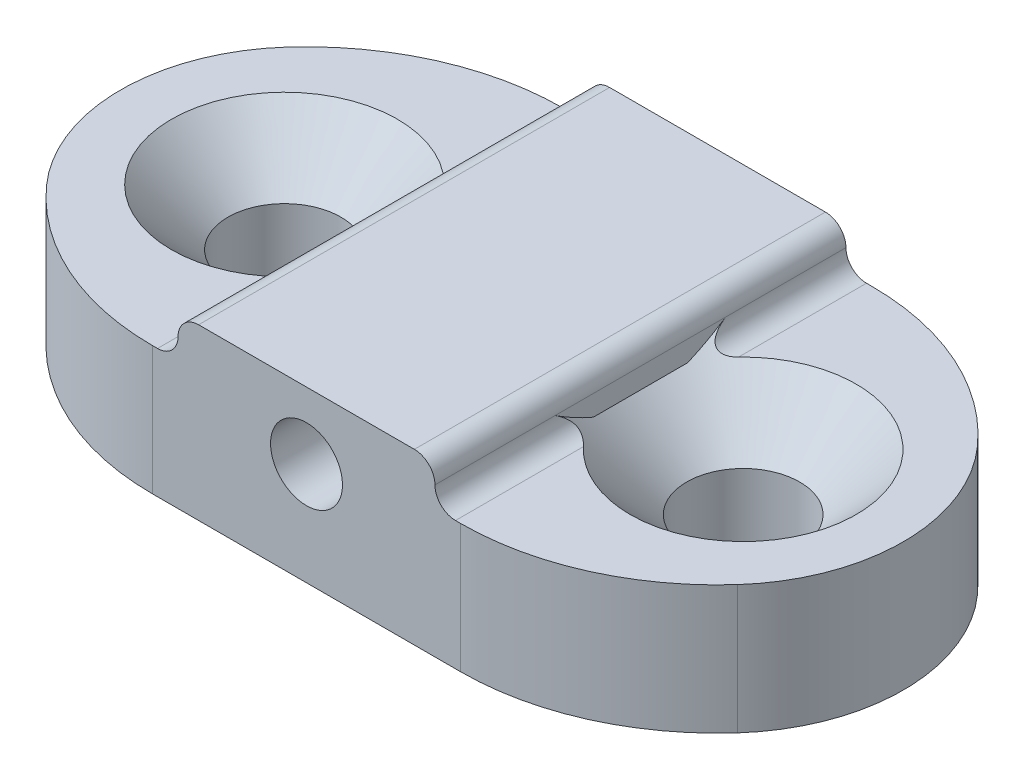
ISO-10303-21;
HEADER;
FILE_DESCRIPTION(('STEP AP214'),'2;1');
FILE_NAME('part.step','',(''),(''),'','','');
FILE_SCHEMA(('AUTOMOTIVE_DESIGN { 1 0 10303 214 1 1 1 1 }'));
ENDSEC;
DATA;
#1=APPLICATION_CONTEXT('core data for automotive mechanical design processes');
#2=APPLICATION_PROTOCOL_DEFINITION('international standard','automotive_design',2000,#1);
#3=PRODUCT_CONTEXT('',#1,'mechanical');
#4=PRODUCT('Part','Part','',(#3));
#5=PRODUCT_RELATED_PRODUCT_CATEGORY('part','',(#4));
#6=PRODUCT_DEFINITION_FORMATION('','',#4);
#7=PRODUCT_DEFINITION_CONTEXT('part definition',#1,'design');
#8=PRODUCT_DEFINITION('design','',#6,#7);
#9=PRODUCT_DEFINITION_SHAPE('','',#8);
#10=(LENGTH_UNIT() NAMED_UNIT(*) SI_UNIT(.MILLI.,.METRE.));
#11=(NAMED_UNIT(*) PLANE_ANGLE_UNIT() SI_UNIT($,.RADIAN.));
#12=(NAMED_UNIT(*) SI_UNIT($,.STERADIAN.) SOLID_ANGLE_UNIT());
#13=UNCERTAINTY_MEASURE_WITH_UNIT(LENGTH_MEASURE(1.E-05),#10,'distance_accuracy_value','');
#14=(GEOMETRIC_REPRESENTATION_CONTEXT(3) GLOBAL_UNCERTAINTY_ASSIGNED_CONTEXT((#13)) GLOBAL_UNIT_ASSIGNED_CONTEXT((#10,
#11,#12)) REPRESENTATION_CONTEXT('',''));
#15=CARTESIAN_POINT('',(0.,0.,0.));
#16=DIRECTION('',(0.,0.,1.));
#17=DIRECTION('',(1.,0.,0.));
#18=AXIS2_PLACEMENT_3D('',#15,#16,#17);
#19=CARTESIAN_POINT('',(0.,2.5,0.));
#20=DIRECTION('',(0.,-1.,0.));
#21=DIRECTION('',(0.,0.,-1.));
#22=AXIS2_PLACEMENT_3D('',#19,#20,#21);
#23=PLANE('',#22);
#24=CARTESIAN_POINT('',(5.,2.5,-3.));
#25=DIRECTION('',(0.,-1.,0.));
#26=DIRECTION('',(0.,0.,-1.));
#27=AXIS2_PLACEMENT_3D('',#24,#25,#26);
#28=CIRCLE('',#27,5.);
#29=CARTESIAN_POINT('',(5.,2.5,-8.));
#30=VERTEX_POINT('',#29);
#31=CARTESIAN_POINT('',(1.27322003750035,2.5,-6.33333333333333));
#32=VERTEX_POINT('',#31);
#33=EDGE_CURVE('E391',#30,#32,#28,.F.);
#34=ORIENTED_EDGE('',*,*,#33,.T.);
#35=CARTESIAN_POINT('',(3.88196601125011,2.5,-4.));
#36=DIRECTION('',(0.,-1.,0.));
#37=DIRECTION('',(0.,0.,-1.));
#38=AXIS2_PLACEMENT_3D('',#35,#36,#37);
#39=CIRCLE('',#38,3.5);
#40=CARTESIAN_POINT('',(1.27322003750035,2.5,-1.66666666666667));
#41=VERTEX_POINT('',#40);
#42=EDGE_CURVE('E396',#32,#41,#39,.F.);
#43=ORIENTED_EDGE('',*,*,#42,.T.);
#44=CARTESIAN_POINT('',(5.,2.5,-5.));
#45=DIRECTION('',(0.,-1.,0.));
#46=DIRECTION('',(0.,0.,-1.));
#47=AXIS2_PLACEMENT_3D('',#44,#45,#46);
#48=CIRCLE('',#47,5.);
#49=CARTESIAN_POINT('',(5.,2.5,0.));
#50=VERTEX_POINT('',#49);
#51=EDGE_CURVE('E389',#41,#50,#48,.F.);
#52=ORIENTED_EDGE('',*,*,#51,.T.);
#53=DIRECTION('',(1.,0.,0.));
#54=VECTOR('',#53,1.);
#55=CARTESIAN_POINT('',(0.,2.5,0.));
#56=LINE('',#55,#54);
#57=CARTESIAN_POINT('',(5.1,2.5,0.));
#58=VERTEX_POINT('',#57);
#59=EDGE_CURVE('E226',#50,#58,#56,.T.);
#60=ORIENTED_EDGE('',*,*,#59,.T.);
#61=DIRECTION('',(0.,0.,1.));
#62=VECTOR('',#61,1.);
#63=CARTESIAN_POINT('',(5.1,2.5,0.));
#64=LINE('',#63,#62);
#65=CARTESIAN_POINT('',(5.1,2.5,-2.41808901716345));
#66=VERTEX_POINT('',#65);
#67=EDGE_CURVE('E283',#58,#66,#64,.F.);
#68=ORIENTED_EDGE('',*,*,#67,.T.);
#69=CARTESIAN_POINT('',(3.57109266389977,2.5,-4.));
#70=DIRECTION('',(0.,1.,0.));
#71=DIRECTION('',(0.,0.,1.));
#72=AXIS2_PLACEMENT_3D('',#69,#70,#71);
#73=CIRCLE('',#72,2.2);
#74=CARTESIAN_POINT('',(5.1,2.5,-5.58191098283655));
#75=VERTEX_POINT('',#74);
#76=EDGE_CURVE('E192',#75,#66,#73,.T.);
#77=ORIENTED_EDGE('',*,*,#76,.F.);
#78=DIRECTION('',(0.,0.,1.));
#79=VECTOR('',#78,1.);
#80=CARTESIAN_POINT('',(5.1,2.5,0.));
#81=LINE('',#80,#79);
#82=CARTESIAN_POINT('',(5.1,2.5,-8.));
#83=VERTEX_POINT('',#82);
#84=EDGE_CURVE('E489',#75,#83,#81,.F.);
#85=ORIENTED_EDGE('',*,*,#84,.T.);
#86=DIRECTION('',(-1.,0.,0.));
#87=VECTOR('',#86,1.);
#88=CARTESIAN_POINT('',(0.,2.5,-8.));
#89=LINE('',#88,#87);
#90=EDGE_CURVE('E228',#83,#30,#89,.T.);
#91=ORIENTED_EDGE('',*,*,#90,.T.);
#92=EDGE_LOOP('',(#34,#43,#52,#60,#68,#77,#85,#91));
#93=FACE_BOUND('',#92,.T.);
#94=ADVANCED_FACE('F35',(#93),#23,.F.);
#95=CARTESIAN_POINT('',(0.,0.,0.));
#96=DIRECTION('',(0.,-1.,0.));
#97=DIRECTION('',(0.,0.,-1.));
#98=AXIS2_PLACEMENT_3D('',#95,#96,#97);
#99=PLANE('',#98);
#100=CARTESIAN_POINT('',(5.,0.,-5.));
#101=DIRECTION('',(0.,-1.,0.));
#102=DIRECTION('',(0.,0.,-1.));
#103=AXIS2_PLACEMENT_3D('',#100,#101,#102);
#104=CIRCLE('',#103,5.);
#105=CARTESIAN_POINT('',(5.,0.,0.));
#106=VERTEX_POINT('',#105);
#107=CARTESIAN_POINT('',(1.27322003750035,0.,-1.66666666666667));
#108=VERTEX_POINT('',#107);
#109=EDGE_CURVE('E420',#106,#108,#104,.T.);
#110=ORIENTED_EDGE('',*,*,#109,.T.);
#111=CARTESIAN_POINT('',(3.88196601125011,0.,-4.));
#112=DIRECTION('',(0.,-1.,0.));
#113=DIRECTION('',(0.,0.,-1.));
#114=AXIS2_PLACEMENT_3D('',#111,#112,#113);
#115=CIRCLE('',#114,3.5);
#116=CARTESIAN_POINT('',(1.27322003750035,0.,-6.33333333333333));
#117=VERTEX_POINT('',#116);
#118=EDGE_CURVE('E402',#108,#117,#115,.T.);
#119=ORIENTED_EDGE('',*,*,#118,.T.);
#120=CARTESIAN_POINT('',(5.,0.,-3.));
#121=DIRECTION('',(0.,-1.,0.));
#122=DIRECTION('',(0.,0.,-1.));
#123=AXIS2_PLACEMENT_3D('',#120,#121,#122);
#124=CIRCLE('',#123,5.);
#125=CARTESIAN_POINT('',(5.,0.,-8.));
#126=VERTEX_POINT('',#125);
#127=EDGE_CURVE('E416',#117,#126,#124,.T.);
#128=ORIENTED_EDGE('',*,*,#127,.T.);
#129=DIRECTION('',(-1.,0.,0.));
#130=VECTOR('',#129,1.);
#131=CARTESIAN_POINT('',(0.,0.,-8.));
#132=LINE('',#131,#130);
#133=CARTESIAN_POINT('',(11.,0.,-8.));
#134=VERTEX_POINT('',#133);
#135=EDGE_CURVE('E235',#134,#126,#132,.T.);
#136=ORIENTED_EDGE('',*,*,#135,.F.);
#137=CARTESIAN_POINT('',(11.,0.,-3.));
#138=DIRECTION('',(0.,-1.,0.));
#139=DIRECTION('',(0.,0.,-1.));
#140=AXIS2_PLACEMENT_3D('',#137,#138,#139);
#141=CIRCLE('',#140,5.);
#142=CARTESIAN_POINT('',(14.7267799624996,0.,-6.33333333333333));
#143=VERTEX_POINT('',#142);
#144=EDGE_CURVE('E414',#134,#143,#141,.T.);
#145=ORIENTED_EDGE('',*,*,#144,.T.);
#146=CARTESIAN_POINT('',(12.1180339887499,0.,-4.));
#147=DIRECTION('',(0.,-1.,0.));
#148=DIRECTION('',(0.,0.,-1.));
#149=AXIS2_PLACEMENT_3D('',#146,#147,#148);
#150=CIRCLE('',#149,3.5);
#151=CARTESIAN_POINT('',(14.7267799624996,0.,-1.66666666666667));
#152=VERTEX_POINT('',#151);
#153=EDGE_CURVE('E400',#143,#152,#150,.T.);
#154=ORIENTED_EDGE('',*,*,#153,.T.);
#155=CARTESIAN_POINT('',(11.,0.,-5.));
#156=DIRECTION('',(0.,-1.,0.));
#157=DIRECTION('',(0.,0.,-1.));
#158=AXIS2_PLACEMENT_3D('',#155,#156,#157);
#159=CIRCLE('',#158,5.);
#160=CARTESIAN_POINT('',(11.,0.,0.));
#161=VERTEX_POINT('',#160);
#162=EDGE_CURVE('E406',#152,#161,#159,.T.);
#163=ORIENTED_EDGE('',*,*,#162,.T.);
#164=DIRECTION('',(1.,0.,0.));
#165=VECTOR('',#164,1.);
#166=CARTESIAN_POINT('',(0.,0.,0.));
#167=LINE('',#166,#165);
#168=EDGE_CURVE('E221',#106,#161,#167,.T.);
#169=ORIENTED_EDGE('',*,*,#168,.F.);
#170=EDGE_LOOP('',(#110,#119,#128,#136,#145,#154,#163,#169));
#171=FACE_BOUND('',#170,.T.);
#172=CARTESIAN_POINT('',(12.5,0.,-4.));
#173=DIRECTION('',(0.,1.,0.));
#174=DIRECTION('',(0.,0.,1.));
#175=AXIS2_PLACEMENT_3D('',#172,#173,#174);
#176=CIRCLE('',#175,1.1);
#177=CARTESIAN_POINT('',(12.5,0.,-2.9));
#178=VERTEX_POINT('',#177);
#179=EDGE_CURVE('E209',#178,#178,#176,.T.);
#180=ORIENTED_EDGE('',*,*,#179,.T.);
#181=EDGE_LOOP('',(#180));
#182=FACE_BOUND('',#181,.T.);
#183=CARTESIAN_POINT('',(3.57109266389977,0.,-4.));
#184=DIRECTION('',(0.,1.,0.));
#185=DIRECTION('',(0.,0.,1.));
#186=AXIS2_PLACEMENT_3D('',#183,#184,#185);
#187=CIRCLE('',#186,1.1);
#188=CARTESIAN_POINT('',(3.57109266389977,0.,-2.9));
#189=VERTEX_POINT('',#188);
#190=EDGE_CURVE('E195',#189,#189,#187,.T.);
#191=ORIENTED_EDGE('',*,*,#190,.T.);
#192=EDGE_LOOP('',(#191));
#193=FACE_BOUND('',#192,.T.);
#194=ADVANCED_FACE('F357',(#171,#182,#193),#99,.T.);
#195=CARTESIAN_POINT('',(11.,2.5,-5.));
#196=DIRECTION('',(0.,-1.,0.));
#197=DIRECTION('',(0.,0.,-1.));
#198=AXIS2_PLACEMENT_3D('',#195,#196,#197);
#199=CIRCLE('',#198,5.);
#200=CARTESIAN_POINT('',(11.,2.5,0.));
#201=VERTEX_POINT('',#200);
#202=CARTESIAN_POINT('',(14.7267799624996,2.5,-1.66666666666667));
#203=VERTEX_POINT('',#202);
#204=EDGE_CURVE('E374',#201,#203,#199,.F.);
#205=ORIENTED_EDGE('',*,*,#204,.T.);
#206=CARTESIAN_POINT('',(12.1180339887499,2.5,-4.));
#207=DIRECTION('',(0.,-1.,0.));
#208=DIRECTION('',(0.,0.,-1.));
#209=AXIS2_PLACEMENT_3D('',#206,#207,#208);
#210=CIRCLE('',#209,3.5);
#211=CARTESIAN_POINT('',(14.7267799624996,2.5,-6.33333333333333));
#212=VERTEX_POINT('',#211);
#213=EDGE_CURVE('E43',#203,#212,#210,.F.);
#214=ORIENTED_EDGE('',*,*,#213,.T.);
#215=CARTESIAN_POINT('',(11.,2.5,-3.));
#216=DIRECTION('',(0.,-1.,0.));
#217=DIRECTION('',(0.,0.,-1.));
#218=AXIS2_PLACEMENT_3D('',#215,#216,#217);
#219=CIRCLE('',#218,5.);
#220=CARTESIAN_POINT('',(11.,2.5,-8.));
#221=VERTEX_POINT('',#220);
#222=EDGE_CURVE('E379',#212,#221,#219,.F.);
#223=ORIENTED_EDGE('',*,*,#222,.T.);
#224=CARTESIAN_POINT('',(10.9,2.5,-8.));
#225=VERTEX_POINT('',#224);
#226=EDGE_CURVE('E230',#221,#225,#89,.T.);
#227=ORIENTED_EDGE('',*,*,#226,.T.);
#228=DIRECTION('',(0.,0.,1.));
#229=VECTOR('',#228,1.);
#230=CARTESIAN_POINT('',(10.9,2.5,0.));
#231=LINE('',#230,#229);
#232=CARTESIAN_POINT('',(10.9,2.5,-5.50996688705415));
#233=VERTEX_POINT('',#232);
#234=EDGE_CURVE('E239',#225,#233,#231,.T.);
#235=ORIENTED_EDGE('',*,*,#234,.T.);
#236=CARTESIAN_POINT('',(12.5,2.5,-4.));
#237=DIRECTION('',(0.,1.,0.));
#238=DIRECTION('',(0.,0.,1.));
#239=AXIS2_PLACEMENT_3D('',#236,#237,#238);
#240=CIRCLE('',#239,2.2);
#241=CARTESIAN_POINT('',(10.9,2.5,-2.49003311294585));
#242=VERTEX_POINT('',#241);
#243=EDGE_CURVE('E202',#242,#233,#240,.T.);
#244=ORIENTED_EDGE('',*,*,#243,.F.);
#245=DIRECTION('',(0.,0.,1.));
#246=VECTOR('',#245,1.);
#247=CARTESIAN_POINT('',(10.9,2.5,0.));
#248=LINE('',#247,#246);
#249=CARTESIAN_POINT('',(10.9,2.5,0.));
#250=VERTEX_POINT('',#249);
#251=EDGE_CURVE('E232',#242,#250,#248,.T.);
#252=ORIENTED_EDGE('',*,*,#251,.T.);
#253=EDGE_CURVE('E229',#250,#201,#56,.T.);
#254=ORIENTED_EDGE('',*,*,#253,.T.);
#255=EDGE_LOOP('',(#205,#214,#223,#227,#235,#244,#252,#254));
#256=FACE_BOUND('',#255,.T.);
#257=ADVANCED_FACE('F360',(#256),#23,.F.);
#258=CARTESIAN_POINT('',(0.,2.5,0.));
#259=DIRECTION('',(0.,0.,-1.));
#260=DIRECTION('',(-1.,0.,0.));
#261=AXIS2_PLACEMENT_3D('',#258,#259,#260);
#262=PLANE('',#261);
#263=CARTESIAN_POINT('',(8.,2.,0.));
#264=DIRECTION('',(0.,0.,-1.));
#265=DIRECTION('',(-1.,0.,0.));
#266=AXIS2_PLACEMENT_3D('',#263,#264,#265);
#267=CIRCLE('',#266,0.7);
#268=CARTESIAN_POINT('',(7.3,2.,0.));
#269=VERTEX_POINT('',#268);
#270=EDGE_CURVE('E215',#269,#269,#267,.T.);
#271=ORIENTED_EDGE('',*,*,#270,.T.);
#272=EDGE_LOOP('',(#271));
#273=FACE_BOUND('',#272,.T.);
#274=ORIENTED_EDGE('',*,*,#168,.T.);
#275=DIRECTION('',(0.,-1.,0.));
#276=VECTOR('',#275,1.);
#277=CARTESIAN_POINT('',(11.,2.5,0.));
#278=LINE('',#277,#276);
#279=EDGE_CURVE('E384',#161,#201,#278,.F.);
#280=ORIENTED_EDGE('',*,*,#279,.T.);
#281=ORIENTED_EDGE('',*,*,#253,.F.);
#282=CARTESIAN_POINT('',(10.9,2.9,0.));
#283=DIRECTION('',(0.,0.,-1.));
#284=DIRECTION('',(-1.,0.,0.));
#285=AXIS2_PLACEMENT_3D('',#282,#283,#284);
#286=CIRCLE('',#285,0.4);
#287=CARTESIAN_POINT('',(10.5,2.9,0.));
#288=VERTEX_POINT('',#287);
#289=EDGE_CURVE('E312',#250,#288,#286,.T.);
#290=ORIENTED_EDGE('',*,*,#289,.T.);
#291=CARTESIAN_POINT('',(10.1,2.9,0.));
#292=DIRECTION('',(0.,0.,-1.));
#293=DIRECTION('',(-1.,0.,0.));
#294=AXIS2_PLACEMENT_3D('',#291,#292,#293);
#295=CIRCLE('',#294,0.4);
#296=CARTESIAN_POINT('',(10.1,3.3,0.));
#297=VERTEX_POINT('',#296);
#298=EDGE_CURVE('E462',#288,#297,#295,.F.);
#299=ORIENTED_EDGE('',*,*,#298,.T.);
#300=DIRECTION('',(-1.,0.,0.));
#301=VECTOR('',#300,1.);
#302=CARTESIAN_POINT('',(5.5,3.3,0.));
#303=LINE('',#302,#301);
#304=CARTESIAN_POINT('',(5.9,3.3,0.));
#305=VERTEX_POINT('',#304);
#306=EDGE_CURVE('E187',#297,#305,#303,.T.);
#307=ORIENTED_EDGE('',*,*,#306,.T.);
#308=CARTESIAN_POINT('',(5.9,2.9,0.));
#309=DIRECTION('',(0.,0.,-1.));
#310=DIRECTION('',(-1.,0.,0.));
#311=AXIS2_PLACEMENT_3D('',#308,#309,#310);
#312=CIRCLE('',#311,0.4);
#313=CARTESIAN_POINT('',(5.5,2.9,0.));
#314=VERTEX_POINT('',#313);
#315=EDGE_CURVE('E465',#305,#314,#312,.F.);
#316=ORIENTED_EDGE('',*,*,#315,.T.);
#317=CARTESIAN_POINT('',(5.1,2.9,0.));
#318=DIRECTION('',(0.,0.,-1.));
#319=DIRECTION('',(-1.,0.,0.));
#320=AXIS2_PLACEMENT_3D('',#317,#318,#319);
#321=CIRCLE('',#320,0.4);
#322=EDGE_CURVE('E311',#314,#58,#321,.T.);
#323=ORIENTED_EDGE('',*,*,#322,.T.);
#324=ORIENTED_EDGE('',*,*,#59,.F.);
#325=DIRECTION('',(0.,-1.,0.));
#326=VECTOR('',#325,1.);
#327=CARTESIAN_POINT('',(5.,2.5,0.));
#328=LINE('',#327,#326);
#329=EDGE_CURVE('E418',#50,#106,#328,.T.);
#330=ORIENTED_EDGE('',*,*,#329,.T.);
#331=EDGE_LOOP('',(#274,#280,#281,#290,#299,#307,#316,#323,#324,#330));
#332=FACE_BOUND('',#331,.T.);
#333=ADVANCED_FACE('F294',(#273,#332),#262,.F.);
#334=CARTESIAN_POINT('',(0.,2.5,-8.));
#335=DIRECTION('',(0.,0.,1.));
#336=DIRECTION('',(1.,0.,0.));
#337=AXIS2_PLACEMENT_3D('',#334,#335,#336);
#338=PLANE('',#337);
#339=CARTESIAN_POINT('',(8.,2.,-8.));
#340=DIRECTION('',(0.,0.,1.));
#341=DIRECTION('',(1.,0.,0.));
#342=AXIS2_PLACEMENT_3D('',#339,#340,#341);
#343=CIRCLE('',#342,0.7);
#344=CARTESIAN_POINT('',(8.7,2.,-8.));
#345=VERTEX_POINT('',#344);
#346=EDGE_CURVE('E212',#345,#345,#343,.T.);
#347=ORIENTED_EDGE('',*,*,#346,.T.);
#348=EDGE_LOOP('',(#347));
#349=FACE_BOUND('',#348,.T.);
#350=ORIENTED_EDGE('',*,*,#226,.F.);
#351=DIRECTION('',(0.,-1.,0.));
#352=VECTOR('',#351,1.);
#353=CARTESIAN_POINT('',(11.,2.5,-8.));
#354=LINE('',#353,#352);
#355=EDGE_CURVE('E382',#221,#134,#354,.T.);
#356=ORIENTED_EDGE('',*,*,#355,.T.);
#357=ORIENTED_EDGE('',*,*,#135,.T.);
#358=DIRECTION('',(0.,-1.,0.));
#359=VECTOR('',#358,1.);
#360=CARTESIAN_POINT('',(5.,2.5,-8.));
#361=LINE('',#360,#359);
#362=EDGE_CURVE('E378',#126,#30,#361,.F.);
#363=ORIENTED_EDGE('',*,*,#362,.T.);
#364=ORIENTED_EDGE('',*,*,#90,.F.);
#365=CARTESIAN_POINT('',(5.1,2.9,-8.));
#366=DIRECTION('',(0.,0.,1.));
#367=DIRECTION('',(1.,0.,0.));
#368=AXIS2_PLACEMENT_3D('',#365,#366,#367);
#369=CIRCLE('',#368,0.4);
#370=CARTESIAN_POINT('',(5.5,2.9,-8.));
#371=VERTEX_POINT('',#370);
#372=EDGE_CURVE('E431',#83,#371,#369,.T.);
#373=ORIENTED_EDGE('',*,*,#372,.T.);
#374=CARTESIAN_POINT('',(5.9,2.9,-8.));
#375=DIRECTION('',(0.,0.,1.));
#376=DIRECTION('',(1.,0.,0.));
#377=AXIS2_PLACEMENT_3D('',#374,#375,#376);
#378=CIRCLE('',#377,0.4);
#379=CARTESIAN_POINT('',(5.9,3.3,-8.));
#380=VERTEX_POINT('',#379);
#381=EDGE_CURVE('E473',#371,#380,#378,.F.);
#382=ORIENTED_EDGE('',*,*,#381,.T.);
#383=DIRECTION('',(1.,0.,0.));
#384=VECTOR('',#383,1.);
#385=CARTESIAN_POINT('',(5.5,3.3,-8.));
#386=LINE('',#385,#384);
#387=CARTESIAN_POINT('',(10.1,3.3,-8.));
#388=VERTEX_POINT('',#387);
#389=EDGE_CURVE('E218',#380,#388,#386,.T.);
#390=ORIENTED_EDGE('',*,*,#389,.T.);
#391=CARTESIAN_POINT('',(10.1,2.9,-8.));
#392=DIRECTION('',(0.,0.,1.));
#393=DIRECTION('',(1.,0.,0.));
#394=AXIS2_PLACEMENT_3D('',#391,#392,#393);
#395=CIRCLE('',#394,0.4);
#396=CARTESIAN_POINT('',(10.5,2.9,-8.));
#397=VERTEX_POINT('',#396);
#398=EDGE_CURVE('E181',#388,#397,#395,.F.);
#399=ORIENTED_EDGE('',*,*,#398,.T.);
#400=CARTESIAN_POINT('',(10.9,2.9,-8.));
#401=DIRECTION('',(0.,0.,1.));
#402=DIRECTION('',(1.,0.,0.));
#403=AXIS2_PLACEMENT_3D('',#400,#401,#402);
#404=CIRCLE('',#403,0.4);
#405=EDGE_CURVE('E282',#397,#225,#404,.T.);
#406=ORIENTED_EDGE('',*,*,#405,.T.);
#407=EDGE_LOOP('',(#350,#356,#357,#363,#364,#373,#382,#390,#399,#406));
#408=FACE_BOUND('',#407,.T.);
#409=ADVANCED_FACE('F371',(#349,#408),#338,.F.);
#410=CARTESIAN_POINT('',(5.5,2.5,-13.0635955604689));
#411=DIRECTION('',(-1.,0.,0.));
#412=DIRECTION('',(0.,-1.,0.));
#413=AXIS2_PLACEMENT_3D('',#410,#411,#412);
#414=PLANE('',#413);
#415=DIRECTION('',(0.,0.,1.));
#416=VECTOR('',#415,1.);
#417=CARTESIAN_POINT('',(5.5,2.5,-13.0635955604689));
#418=LINE('',#417,#416);
#419=CARTESIAN_POINT('',(5.5,2.5,-5.05797754642464));
#420=VERTEX_POINT('',#419);
#421=CARTESIAN_POINT('',(5.5,2.5,-2.94202245357537));
#422=VERTEX_POINT('',#421);
#423=EDGE_CURVE('E174',#420,#422,#418,.T.);
#424=ORIENTED_EDGE('',*,*,#423,.T.);
#425=CARTESIAN_POINT('',(5.5,2.5,-2.94202245357537));
#426=CARTESIAN_POINT('',(5.5,2.52872917775644,-2.8823228496387));
#427=CARTESIAN_POINT('',(5.5,2.55893294478922,-2.82335937948788));
#428=CARTESIAN_POINT('',(5.5,2.62175738827018,-2.70682487240755));
#429=CARTESIAN_POINT('',(5.5,2.6543750152887,-2.64925219651247));
#430=CARTESIAN_POINT('',(5.5,2.72155791669848,-2.53529023365637));
#431=CARTESIAN_POINT('',(5.5,2.75612255971361,-2.47890057111754));
#432=CARTESIAN_POINT('',(5.5,2.82691084229986,-2.36707219379437));
#433=CARTESIAN_POINT('',(5.5,2.86313648702678,-2.31163474568505));
#434=CARTESIAN_POINT('',(5.5,2.90000000000016,-2.25663644389946));
#435=B_SPLINE_CURVE_WITH_KNOTS('',3,(#425,#426,#427,#428,#429,#430,#431,#432,#433,#434),
.UNSPECIFIED.,.F.,.F.,(4,2,2,2,4),(0.,0.198703135537781,0.397159399098891,0.595551673880546,
0.794190099681821),.UNSPECIFIED.);
#436=CARTESIAN_POINT('',(5.5,2.9,-2.25663644389938));
#437=VERTEX_POINT('',#436);
#438=EDGE_CURVE('E190',#422,#437,#435,.T.);
#439=ORIENTED_EDGE('',*,*,#438,.T.);
#440=DIRECTION('',(0.,0.,1.));
#441=VECTOR('',#440,1.);
#442=CARTESIAN_POINT('',(5.5,2.9,-13.0635955604689));
#443=LINE('',#442,#441);
#444=CARTESIAN_POINT('',(5.5,2.9,-5.74336355610062));
#445=VERTEX_POINT('',#444);
#446=EDGE_CURVE('E177',#437,#445,#443,.F.);
#447=ORIENTED_EDGE('',*,*,#446,.T.);
#448=CARTESIAN_POINT('',(5.5,2.9,-5.74336355610062));
#449=CARTESIAN_POINT('',(5.5,2.86313648702672,-5.68836525431497));
#450=CARTESIAN_POINT('',(5.5,2.82691084229984,-5.63292780620563));
#451=CARTESIAN_POINT('',(5.5,2.75612255971362,-5.52109942888244));
#452=CARTESIAN_POINT('',(5.5,2.72155791669848,-5.46470976634362));
#453=CARTESIAN_POINT('',(5.5,2.65437501528869,-5.35074780348753));
#454=CARTESIAN_POINT('',(5.5,2.62175738827018,-5.29317512759244));
#455=CARTESIAN_POINT('',(5.5,2.55893294478922,-5.17664062051212));
#456=CARTESIAN_POINT('',(5.5,2.52872917775645,-5.1176771503613));
#457=CARTESIAN_POINT('',(5.5,2.5,-5.05797754642464));
#458=B_SPLINE_CURVE_WITH_KNOTS('',3,(#448,#449,#450,#451,#452,#453,#454,#455,#456,#457),
.UNSPECIFIED.,.F.,.F.,(4,2,2,2,4),(0.,0.198638425801264,0.397030700582911,0.595486964144019,
0.794190099681793),.UNSPECIFIED.);
#459=EDGE_CURVE('E170',#445,#420,#458,.T.);
#460=ORIENTED_EDGE('',*,*,#459,.T.);
#461=EDGE_LOOP('',(#424,#439,#447,#460));
#462=FACE_BOUND('',#461,.T.);
#463=ADVANCED_FACE('F172',(#462),#414,.T.);
#464=CARTESIAN_POINT('',(5.5,3.3,-13.0635955604689));
#465=DIRECTION('',(0.,1.,0.));
#466=DIRECTION('',(-1.,0.,0.));
#467=AXIS2_PLACEMENT_3D('',#464,#465,#466);
#468=PLANE('',#467);
#469=ORIENTED_EDGE('',*,*,#306,.F.);
#470=DIRECTION('',(0.,0.,1.));
#471=VECTOR('',#470,1.);
#472=CARTESIAN_POINT('',(10.1,3.3,-13.0635955604689));
#473=LINE('',#472,#471);
#474=EDGE_CURVE('E471',#297,#388,#473,.F.);
#475=ORIENTED_EDGE('',*,*,#474,.T.);
#476=ORIENTED_EDGE('',*,*,#389,.F.);
#477=DIRECTION('',(0.,0.,1.));
#478=VECTOR('',#477,1.);
#479=CARTESIAN_POINT('',(5.9,3.3,-13.0635955604689));
#480=LINE('',#479,#478);
#481=EDGE_CURVE('E464',#380,#305,#480,.T.);
#482=ORIENTED_EDGE('',*,*,#481,.T.);
#483=EDGE_LOOP('',(#469,#475,#476,#482));
#484=FACE_BOUND('',#483,.T.);
#485=ADVANCED_FACE('F469',(#484),#468,.T.);
#486=CARTESIAN_POINT('',(10.5,2.5,-13.0635955604689));
#487=DIRECTION('',(1.,0.,0.));
#488=DIRECTION('',(0.,1.,0.));
#489=AXIS2_PLACEMENT_3D('',#486,#487,#488);
#490=PLANE('',#489);
#491=DIRECTION('',(0.,0.,1.));
#492=VECTOR('',#491,1.);
#493=CARTESIAN_POINT('',(10.5,2.5,-13.0635955604689));
#494=LINE('',#493,#492);
#495=CARTESIAN_POINT('',(10.5,2.5,-4.91651513899117));
#496=VERTEX_POINT('',#495);
#497=CARTESIAN_POINT('',(10.5,2.5,-3.08348486100883));
#498=VERTEX_POINT('',#497);
#499=EDGE_CURVE('E186',#496,#498,#494,.T.);
#500=ORIENTED_EDGE('',*,*,#499,.F.);
#501=CARTESIAN_POINT('',(10.5,2.5,-4.91651513899117));
#502=CARTESIAN_POINT('',(10.5,2.52718727449056,-4.98172105472955));
#503=CARTESIAN_POINT('',(10.5,2.55636217171402,-5.04605522553401));
#504=CARTESIAN_POINT('',(10.5,2.61794446605888,-5.17301690717014));
#505=CARTESIAN_POINT('',(10.5,2.65034577979058,-5.23564735663984));
#506=CARTESIAN_POINT('',(10.5,2.71772744515605,-5.35944845668019));
#507=CARTESIAN_POINT('',(10.5,2.75270653042835,-5.42061980475769));
#508=CARTESIAN_POINT('',(10.5,2.82484715782165,-5.54181848776246));
#509=CARTESIAN_POINT('',(10.5,2.86201261655119,-5.60184349772124));
#510=CARTESIAN_POINT('',(10.5,2.9,-5.66132477258362));
#511=B_SPLINE_CURVE_WITH_KNOTS('',3,(#501,#502,#503,#504,#505,#506,#507,#508,#509,#510),
.UNSPECIFIED.,.F.,.F.,(4,2,2,2,4),(0.,0.211850082373242,0.423308025594079,0.634662771281031,
0.846408397578629),.UNSPECIFIED.);
#512=CARTESIAN_POINT('',(10.5,2.9,-5.66132477258362));
#513=VERTEX_POINT('',#512);
#514=EDGE_CURVE('E252',#496,#513,#511,.T.);
#515=ORIENTED_EDGE('',*,*,#514,.T.);
#516=DIRECTION('',(0.,0.,1.));
#517=VECTOR('',#516,1.);
#518=CARTESIAN_POINT('',(10.5,2.9,-13.0635955604689));
#519=LINE('',#518,#517);
#520=CARTESIAN_POINT('',(10.5,2.9,-2.33867522741638));
#521=VERTEX_POINT('',#520);
#522=EDGE_CURVE('E242',#513,#521,#519,.T.);
#523=ORIENTED_EDGE('',*,*,#522,.T.);
#524=CARTESIAN_POINT('',(10.5,2.9,-2.33867522741638));
#525=CARTESIAN_POINT('',(10.5,2.86201261655119,-2.39815650227876));
#526=CARTESIAN_POINT('',(10.5,2.82484715782165,-2.45818151223754));
#527=CARTESIAN_POINT('',(10.5,2.75270653042835,-2.57938019524231));
#528=CARTESIAN_POINT('',(10.5,2.71772744515605,-2.64055154331982));
#529=CARTESIAN_POINT('',(10.5,2.65034577979058,-2.76435264336016));
#530=CARTESIAN_POINT('',(10.5,2.61794446605888,-2.82698309282986));
#531=CARTESIAN_POINT('',(10.5,2.55636217171402,-2.95394477446599));
#532=CARTESIAN_POINT('',(10.5,2.52718727449056,-3.01827894527045));
#533=CARTESIAN_POINT('',(10.5,2.5,-3.08348486100883));
#534=B_SPLINE_CURVE_WITH_KNOTS('',3,(#524,#525,#526,#527,#528,#529,#530,#531,#532,#533),
.UNSPECIFIED.,.F.,.F.,(4,2,2,2,4),(0.,0.2117456262976,0.423100371984554,0.634558315205392,
0.846408397578635),.UNSPECIFIED.);
#535=EDGE_CURVE('E245',#521,#498,#534,.T.);
#536=ORIENTED_EDGE('',*,*,#535,.T.);
#537=EDGE_LOOP('',(#500,#515,#523,#536));
#538=FACE_BOUND('',#537,.T.);
#539=ADVANCED_FACE('F257',(#538),#490,.T.);
#540=CARTESIAN_POINT('',(8.,2.,-8.));
#541=DIRECTION('',(0.,0.,1.));
#542=DIRECTION('',(1.,0.,0.));
#543=AXIS2_PLACEMENT_3D('',#540,#541,#542);
#544=CYLINDRICAL_SURFACE('',#543,0.7);
#545=ORIENTED_EDGE('',*,*,#346,.F.);
#546=EDGE_LOOP('',(#545));
#547=FACE_BOUND('',#546,.T.);
#548=ORIENTED_EDGE('',*,*,#270,.F.);
#549=EDGE_LOOP('',(#548));
#550=FACE_BOUND('',#549,.T.);
#551=ADVANCED_FACE('F617',(#547,#550),#544,.F.);
#552=CARTESIAN_POINT('',(14.7,2.5,-4.));
#553=DIRECTION('',(0.,1.,0.));
#554=DIRECTION('',(0.,0.,1.));
#555=AXIS2_PLACEMENT_3D('',#552,#553,#554);
#556=PLANE('',#555);
#557=ORIENTED_EDGE('',*,*,#499,.T.);
#558=EDGE_CURVE('E203',#496,#498,#240,.T.);
#559=ORIENTED_EDGE('',*,*,#558,.F.);
#560=EDGE_LOOP('',(#557,#559));
#561=FACE_BOUND('',#560,.T.);
#562=ADVANCED_FACE('F609',(#561),#556,.F.);
#563=CARTESIAN_POINT('',(12.5,2.5,-4.));
#564=DIRECTION('',(0.,1.,0.));
#565=DIRECTION('',(0.,0.,1.));
#566=AXIS2_PLACEMENT_3D('',#563,#564,#565);
#567=CYLINDRICAL_SURFACE('',#566,1.1);
#568=ORIENTED_EDGE('',*,*,#179,.F.);
#569=EDGE_LOOP('',(#568));
#570=FACE_BOUND('',#569,.T.);
#571=CARTESIAN_POINT('',(12.5,1.4,-4.));
#572=DIRECTION('',(0.,1.,0.));
#573=DIRECTION('',(0.,0.,1.));
#574=AXIS2_PLACEMENT_3D('',#571,#572,#573);
#575=CIRCLE('',#574,1.1);
#576=CARTESIAN_POINT('',(12.5,1.4,-2.9));
#577=VERTEX_POINT('',#576);
#578=EDGE_CURVE('E206',#577,#577,#575,.T.);
#579=ORIENTED_EDGE('',*,*,#578,.T.);
#580=EDGE_LOOP('',(#579));
#581=FACE_BOUND('',#580,.T.);
#582=ADVANCED_FACE('F266',(#570,#581),#567,.F.);
#583=CARTESIAN_POINT('',(12.5,2.5,-4.));
#584=DIRECTION('',(0.,1.,0.));
#585=DIRECTION('',(0.,0.,1.));
#586=AXIS2_PLACEMENT_3D('',#583,#584,#585);
#587=CONICAL_SURFACE('',#586,2.2,0.785398163397448);
#588=ORIENTED_EDGE('',*,*,#578,.F.);
#589=EDGE_LOOP('',(#588));
#590=FACE_BOUND('',#589,.T.);
#591=ORIENTED_EDGE('',*,*,#558,.T.);
#592=ORIENTED_EDGE('',*,*,#535,.F.);
#593=CARTESIAN_POINT('',(10.5,2.9,-2.33867522741638));
#594=CARTESIAN_POINT('',(10.5000082115001,2.88928184889667,-2.35543698650999));
#595=CARTESIAN_POINT('',(10.5004313809724,2.87840196629674,-2.37210715317471));
#596=CARTESIAN_POINT('',(10.5022445597365,2.85621944205861,-2.40520183485894));
#597=CARTESIAN_POINT('',(10.5036382940098,2.84491533092787,-2.42162515356213));
#598=CARTESIAN_POINT('',(10.5075543072099,2.82173213370308,-2.45422182633193));
#599=CARTESIAN_POINT('',(10.5100895929725,2.80984786962051,-2.47039001129778));
#600=CARTESIAN_POINT('',(10.51651299931,2.78556364454504,-2.5020285714298));
#601=CARTESIAN_POINT('',(10.5203987895313,2.77316460406494,-2.51750009709939));
#602=CARTESIAN_POINT('',(10.5286496397397,2.75100210123375,-2.54355370103504));
#603=CARTESIAN_POINT('',(10.5326361853925,2.74137826352862,-2.55437210633327));
#604=CARTESIAN_POINT('',(10.5417500176447,2.72174695607069,-2.57516743955946));
#605=CARTESIAN_POINT('',(10.5468773942677,2.7117394560945,-2.58514430099501));
#606=CARTESIAN_POINT('',(10.558605701714,2.69121356762826,-2.60396690067397));
#607=CARTESIAN_POINT('',(10.5652248310792,2.6806902459439,-2.61279634271062));
#608=CARTESIAN_POINT('',(10.5801917406879,2.65939612437952,-2.62847108877861));
#609=CARTESIAN_POINT('',(10.5885330179989,2.6486263872187,-2.63532363084752));
#610=CARTESIAN_POINT('',(10.6039128580293,2.63089174530198,-2.64430467375412));
#611=CARTESIAN_POINT('',(10.6104226849201,2.62388415559201,-2.64724728385563));
#612=CARTESIAN_POINT('',(10.6241861626942,2.6101362992266,-2.65164645237734));
#613=CARTESIAN_POINT('',(10.631439107581,2.60339578712653,-2.65310440714174));
#614=CARTESIAN_POINT('',(10.6465319866877,2.59039812427842,-2.65441656338549));
#615=CARTESIAN_POINT('',(10.6543732135156,2.58414210318983,-2.65426712405161));
#616=CARTESIAN_POINT('',(10.6703845377211,2.57231706245705,-2.65242365793966));
#617=CARTESIAN_POINT('',(10.6785549020436,2.5667486159744,-2.65072835226743));
#618=CARTESIAN_POINT('',(10.6972460533728,2.55497250694134,-2.64535849488883));
#619=CARTESIAN_POINT('',(10.707798170129,2.54900694770339,-2.64126925884805));
#620=CARTESIAN_POINT('',(10.728770642434,2.53830954920871,-2.63146699880835));
#621=CARTESIAN_POINT('',(10.7391906308501,2.53358063671031,-2.62575018839405));
#622=CARTESIAN_POINT('',(10.7662465349036,2.52258988500056,-2.60919376397902));
#623=CARTESIAN_POINT('',(10.7826588204232,2.51724174862954,-2.59739698155804));
#624=CARTESIAN_POINT('',(10.8146774305171,2.50885424647161,-2.57201912184637));
#625=CARTESIAN_POINT('',(10.8302809080553,2.50582258000457,-2.55843226873657));
#626=CARTESIAN_POINT('',(10.8548997267719,2.50243789828712,-2.53557481421081));
#627=CARTESIAN_POINT('',(10.8641550906149,2.50150404996848,-2.52663773825739));
#628=CARTESIAN_POINT('',(10.8823144621081,2.50028889474641,-2.50851475190431));
#629=CARTESIAN_POINT('',(10.8912207125452,2.50000235071077,-2.49933145134352));
#630=CARTESIAN_POINT('',(10.9000000000022,2.4999999999963,-2.4900331129488));
#631=B_SPLINE_CURVE_WITH_KNOTS('',3,(#593,#594,#595,#596,#597,#598,#599,#600,#601,#602,#603,
#604,#605,#606,#607,#608,#609,#610,#611,#612,#613,#614,#615,#616,#617,#618,#619,#620,#621,#622,
#623,#624,#625,#626,#627,#628,#629,#630),.UNSPECIFIED.,.F.,.F.,(4,2,2,2,2,2,2,2,2,2,2,2,2,2,2,2,
2,2,4),(0.,0.0596969180766508,0.119624221948447,0.180252328134844,0.240776333102282,
0.285777723638769,0.330782666519025,0.376369614131377,0.421787471830135,0.451686511017577,
0.481557403592904,0.511495969180004,0.541459325415419,0.579622595075581,0.617875384227349,
0.680249383347249,0.742829805667947,0.78150775100625,0.819871627262304),.UNSPECIFIED.);
#632=EDGE_CURVE('E306',#521,#242,#631,.T.);
#633=ORIENTED_EDGE('',*,*,#632,.T.);
#634=ORIENTED_EDGE('',*,*,#243,.T.);
#635=CARTESIAN_POINT('',(10.9,2.5,-5.50996688705415));
#636=CARTESIAN_POINT('',(10.89095148795,2.50000278412556,-5.5003824739581));
#637=CARTESIAN_POINT('',(10.8817755963747,2.50030660862329,-5.49092934625797));
#638=CARTESIAN_POINT('',(10.8630999130022,2.50159484214976,-5.47232915485972));
#639=CARTESIAN_POINT('',(10.8535990654736,2.50258172002601,-5.46318332802342));
#640=CARTESIAN_POINT('',(10.8242887363401,2.50672734012162,-5.43608411646345));
#641=CARTESIAN_POINT('',(10.8039659307153,2.51107649227757,-5.41878895375473));
#642=CARTESIAN_POINT('',(10.7726866125124,2.52065052885067,-5.39564826732727));
#643=CARTESIAN_POINT('',(10.7622389187228,2.52429773124547,-5.38846171783246));
#644=CARTESIAN_POINT('',(10.7410766118703,2.53274982918775,-5.37531661793096));
#645=CARTESIAN_POINT('',(10.7303631657617,2.53755026668816,-5.36935349881667));
#646=CARTESIAN_POINT('',(10.7104842940797,2.54759787445383,-5.35993023281932));
#647=CARTESIAN_POINT('',(10.7013419683236,2.5526543700821,-5.35622340013142));
#648=CARTESIAN_POINT('',(10.6831307328907,2.56372507370143,-5.35036959346878));
#649=CARTESIAN_POINT('',(10.6740617561525,2.56973826955585,-5.34822098418426));
#650=CARTESIAN_POINT('',(10.6562050048475,2.58268880949329,-5.34578166531657));
#651=CARTESIAN_POINT('',(10.647420373576,2.58963375793891,-5.34550732699135));
#652=CARTESIAN_POINT('',(10.6305632793084,2.60414933909905,-5.34697061605468));
#653=CARTESIAN_POINT('',(10.6224909141937,2.61172005753246,-5.3487085195086));
#654=CARTESIAN_POINT('',(10.6083107897731,2.62612764168212,-5.35365630510975));
#655=CARTESIAN_POINT('',(10.6020844477334,2.63292877796882,-5.35664056082613));
#656=CARTESIAN_POINT('',(10.5903916684481,2.64657652404887,-5.36375127601687));
#657=CARTESIAN_POINT('',(10.5849254233283,2.65342314488256,-5.36787802348754));
#658=CARTESIAN_POINT('',(10.57105906742,2.6719382669796,-5.38031879447169));
#659=CARTESIAN_POINT('',(10.5633675664334,2.68354219051667,-5.38951285400012));
#660=CARTESIAN_POINT('',(10.5497640418162,2.70632147287976,-5.40960272355589));
#661=CARTESIAN_POINT('',(10.5438589850982,2.7174950091924,-5.42050495074448));
#662=CARTESIAN_POINT('',(10.5285457018978,2.74972788854458,-5.4541923302043));
#663=CARTESIAN_POINT('',(10.5211059185057,2.77014289234727,-5.47846453245346));
#664=CARTESIAN_POINT('',(10.5098205743706,2.80957111026032,-5.52886103478543));
#665=CARTESIAN_POINT('',(10.505984837035,2.82858036376107,-5.55499018925042));
#666=CARTESIAN_POINT('',(10.5023065370367,2.85614409950149,-5.59473671398908));
#667=CARTESIAN_POINT('',(10.5014254087938,2.86511297140259,-5.60798129228236));
#668=CARTESIAN_POINT('',(10.5002749762774,2.88275517540316,-5.63457119722973));
#669=CARTESIAN_POINT('',(10.5000018127919,2.89143002545175,-5.64791534574849));
#670=CARTESIAN_POINT('',(10.4999999999999,2.89999999999975,-5.66132477258378));
#671=B_SPLINE_CURVE_WITH_KNOTS('',3,(#635,#636,#637,#638,#639,#640,#641,#642,#643,#644,#645,
#646,#647,#648,#649,#650,#651,#652,#653,#654,#655,#656,#657,#658,#659,#660,#661,#662,#663,#664,
#665,#666,#667,#668,#669,#670),.UNSPECIFIED.,.F.,.F.,(4,2,2,2,2,2,2,2,2,2,2,2,2,2,2,2,2,4),(0.,
0.0395185015250118,0.0791805908923919,0.159801891436203,0.199308695045002,0.238665167922435,
0.271798254220734,0.304896517797985,0.338283520397399,0.371675104000363,0.400640951860443,
0.429614108014082,0.479373150729277,0.529323817648211,0.626514212822978,0.723968754074214,
0.772015281860424,0.819755941512631),.UNSPECIFIED.);
#672=EDGE_CURVE('E275',#233,#513,#671,.T.);
#673=ORIENTED_EDGE('',*,*,#672,.T.);
#674=ORIENTED_EDGE('',*,*,#514,.F.);
#675=EDGE_LOOP('',(#591,#592,#633,#634,#673,#674));
#676=FACE_BOUND('',#675,.T.);
#677=ADVANCED_FACE('F261',(#590,#676),#587,.F.);
#678=CARTESIAN_POINT('',(5.77109266389977,2.5,-4.));
#679=DIRECTION('',(0.,1.,0.));
#680=DIRECTION('',(0.,0.,1.));
#681=AXIS2_PLACEMENT_3D('',#678,#679,#680);
#682=PLANE('',#681);
#683=ORIENTED_EDGE('',*,*,#423,.F.);
#684=EDGE_CURVE('E185',#422,#420,#73,.T.);
#685=ORIENTED_EDGE('',*,*,#684,.F.);
#686=EDGE_LOOP('',(#683,#685));
#687=FACE_BOUND('',#686,.T.);
#688=ADVANCED_FACE('F184',(#687),#682,.F.);
#689=CARTESIAN_POINT('',(3.57109266389977,2.5,-4.));
#690=DIRECTION('',(0.,1.,0.));
#691=DIRECTION('',(0.,0.,1.));
#692=AXIS2_PLACEMENT_3D('',#689,#690,#691);
#693=CYLINDRICAL_SURFACE('',#692,1.1);
#694=ORIENTED_EDGE('',*,*,#190,.F.);
#695=EDGE_LOOP('',(#694));
#696=FACE_BOUND('',#695,.T.);
#697=CARTESIAN_POINT('',(3.57109266389977,1.4,-4.));
#698=DIRECTION('',(0.,1.,0.));
#699=DIRECTION('',(0.,0.,1.));
#700=AXIS2_PLACEMENT_3D('',#697,#698,#699);
#701=CIRCLE('',#700,1.1);
#702=CARTESIAN_POINT('',(3.57109266389977,1.4,-2.9));
#703=VERTEX_POINT('',#702);
#704=EDGE_CURVE('E191',#703,#703,#701,.T.);
#705=ORIENTED_EDGE('',*,*,#704,.T.);
#706=EDGE_LOOP('',(#705));
#707=FACE_BOUND('',#706,.T.);
#708=ADVANCED_FACE('F581',(#696,#707),#693,.F.);
#709=CARTESIAN_POINT('',(3.57109266389977,2.5,-4.));
#710=DIRECTION('',(0.,1.,0.));
#711=DIRECTION('',(0.,0.,1.));
#712=AXIS2_PLACEMENT_3D('',#709,#710,#711);
#713=CONICAL_SURFACE('',#712,2.2,0.785398163397448);
#714=ORIENTED_EDGE('',*,*,#704,.F.);
#715=EDGE_LOOP('',(#714));
#716=FACE_BOUND('',#715,.T.);
#717=ORIENTED_EDGE('',*,*,#684,.T.);
#718=ORIENTED_EDGE('',*,*,#459,.F.);
#719=CARTESIAN_POINT('',(5.5,2.9,-5.74336355610062));
#720=CARTESIAN_POINT('',(5.49999136763082,2.88892369684227,-5.72685653939563));
#721=CARTESIAN_POINT('',(5.49953929041826,2.87767595938755,-5.71045096726849));
#722=CARTESIAN_POINT('',(5.49760065747495,2.85473763389681,-5.67791060651088));
#723=CARTESIAN_POINT('',(5.4961096432398,2.84304534332893,-5.66177729302956));
#724=CARTESIAN_POINT('',(5.49191431487362,2.81904794940522,-5.62977458499987));
#725=CARTESIAN_POINT('',(5.48919351089556,2.80673660843164,-5.61391192327921));
#726=CARTESIAN_POINT('',(5.4822990169416,2.7816049914364,-5.58295502524112));
#727=CARTESIAN_POINT('',(5.47812813328771,2.76878574052082,-5.56785936875936));
#728=CARTESIAN_POINT('',(5.46923127657779,2.74579158070104,-5.54240174889348));
#729=CARTESIAN_POINT('',(5.46489596415807,2.73574432954036,-5.53179059012286));
#730=CARTESIAN_POINT('',(5.45498868895684,2.71530569382548,-5.51150928611));
#731=CARTESIAN_POINT('',(5.4494173628034,2.70491448876586,-5.50183866010684));
#732=CARTESIAN_POINT('',(5.43669570211774,2.68368680494989,-5.48374460890664));
#733=CARTESIAN_POINT('',(5.42952511077936,2.67284621392814,-5.4753397364947));
#734=CARTESIAN_POINT('',(5.41339260865433,2.65106890020263,-5.46063604104729));
#735=CARTESIAN_POINT('',(5.40443700821382,2.64013264236294,-5.45433000218358));
#736=CARTESIAN_POINT('',(5.38776546943453,2.62198553483326,-5.44613924064814));
#737=CARTESIAN_POINT('',(5.38053442191228,2.61467685951503,-5.4434889345194));
#738=CARTESIAN_POINT('',(5.36530509728891,2.60046485007593,-5.43977474958797));
#739=CARTESIAN_POINT('',(5.35730735644765,2.59356123800578,-5.43870977043001));
#740=CARTESIAN_POINT('',(5.34075354069501,2.58039136539911,-5.43823154861351));
#741=CARTESIAN_POINT('',(5.33219723062171,2.57412537618458,-5.43881900608144));
#742=CARTESIAN_POINT('',(5.31478580039523,2.56239427703476,-5.44152882454392));
#743=CARTESIAN_POINT('',(5.30593043553671,2.55692984352401,-5.44365247305277));
#744=CARTESIAN_POINT('',(5.2851411752602,2.54516266383084,-5.45013860868419));
#745=CARTESIAN_POINT('',(5.27317731648408,2.53919977347245,-5.45501490675438));
#746=CARTESIAN_POINT('',(5.24943214509841,2.52873251078828,-5.46648326709478));
#747=CARTESIAN_POINT('',(5.23765142605589,2.52423220101591,-5.47308001823973));
#748=CARTESIAN_POINT('',(5.20717133572129,2.51411124228026,-5.49197358183871));
#749=CARTESIAN_POINT('',(5.18874297697942,2.50954446249764,-5.50525825074156));
#750=CARTESIAN_POINT('',(5.15289622524546,2.503093906716,-5.53363501654749));
#751=CARTESIAN_POINT('',(5.13547881597328,2.50121270331981,-5.54872883151258));
#752=CARTESIAN_POINT('',(5.11229728844507,2.50014139672036,-5.57015414234851));
#753=CARTESIAN_POINT('',(5.10611666919671,2.50000217616796,-5.57600310781624));
#754=CARTESIAN_POINT('',(5.1,2.5,-5.58191098283654));
#755=B_SPLINE_CURVE_WITH_KNOTS('',3,(#719,#720,#721,#722,#723,#724,#725,#726,#727,#728,#729,
#730,#731,#732,#733,#734,#735,#736,#737,#738,#739,#740,#741,#742,#743,#744,#745,#746,#747,#748,
#749,#750,#751,#752,#753,#754),.UNSPECIFIED.,.F.,.F.,(4,2,2,2,2,2,2,2,2,2,2,2,2,2,2,2,2,4),(0.,
0.0596477017575986,0.119552965485268,0.180286468266079,0.240903082535902,0.286568445804732,
0.332210342801464,0.378466985993911,0.424562914442398,0.456278064201081,0.487971190597048,
0.519677747183257,0.551410908542076,0.593857943597616,0.636421893985566,0.705551885189715,
0.774748053974386,0.800269433356907),.UNSPECIFIED.);
#756=EDGE_CURVE('E322',#445,#75,#755,.T.);
#757=ORIENTED_EDGE('',*,*,#756,.T.);
#758=ORIENTED_EDGE('',*,*,#76,.T.);
#759=CARTESIAN_POINT('',(5.1,2.5,-2.41808901716345));
#760=CARTESIAN_POINT('',(5.11692133041905,2.50003894899364,-2.43436046984483));
#761=CARTESIAN_POINT('',(5.13437719861686,2.50107989764037,-2.45033373557224));
#762=CARTESIAN_POINT('',(5.17064177926314,2.50584289317805,-2.48087968445439));
#763=CARTESIAN_POINT('',(5.18946911124822,2.50961258606489,-2.49542218823794));
#764=CARTESIAN_POINT('',(5.2202393500693,2.5183171724471,-2.51627811294098));
#765=CARTESIAN_POINT('',(5.23184753051378,2.52214440139781,-2.52352411295638));
#766=CARTESIAN_POINT('',(5.25530501204877,2.53116729652256,-2.53654741340937));
#767=CARTESIAN_POINT('',(5.26715293592996,2.53635649660564,-2.54233140668581));
#768=CARTESIAN_POINT('',(5.28855252073546,2.54706784244601,-2.55095587005838));
#769=CARTESIAN_POINT('',(5.2980931082356,2.55231938584599,-2.55415273972654));
#770=CARTESIAN_POINT('',(5.31699789762438,2.56379505532083,-2.55894307079807));
#771=CARTESIAN_POINT('',(5.32636223187244,2.57001841604404,-2.56053778668756));
#772=CARTESIAN_POINT('',(5.34467185542493,2.58335426407295,-2.56188872103206));
#773=CARTESIAN_POINT('',(5.35361432975182,2.59047180620146,-2.56163397850841));
#774=CARTESIAN_POINT('',(5.37071131352408,2.60530752215562,-2.55922406483087));
#775=CARTESIAN_POINT('',(5.37886550969666,2.61302593259283,-2.55706814153826));
#776=CARTESIAN_POINT('',(5.39352885789877,2.62807738384482,-2.55131943728797));
#777=CARTESIAN_POINT('',(5.40011916236,2.6353865312037,-2.54786607510296));
#778=CARTESIAN_POINT('',(5.41244871236122,2.65006454119901,-2.53979058814684));
#779=CARTESIAN_POINT('',(5.41818775852928,2.65743341739958,-2.53516819026119));
#780=CARTESIAN_POINT('',(5.43288616908157,2.67764712181402,-2.52117189759783));
#781=CARTESIAN_POINT('',(5.4410122216884,2.6904328502528,-2.51084274737851));
#782=CARTESIAN_POINT('',(5.45523538705334,2.71556300021158,-2.48838860090407));
#783=CARTESIAN_POINT('',(5.46132419361738,2.7279054362388,-2.47625653711308));
#784=CARTESIAN_POINT('',(5.4767556022259,2.76324073630332,-2.43918047948757));
#785=CARTESIAN_POINT('',(5.48392988001396,2.78557283722739,-2.41272796474606));
#786=CARTESIAN_POINT('',(5.49421529035315,2.82871211006536,-2.35795854285852));
#787=CARTESIAN_POINT('',(5.49732038421048,2.84951697245789,-2.32963893018853));
#788=CARTESIAN_POINT('',(5.49924086329429,2.8748451527017,-2.29351240304075));
#789=CARTESIAN_POINT('',(5.49952836428084,2.87993744920735,-2.28616158744766));
#790=CARTESIAN_POINT('',(5.49990776758189,2.89003135748862,-2.27142738195627));
#791=CARTESIAN_POINT('',(5.50000029161479,2.89503320693427,-2.26404417105339));
#792=CARTESIAN_POINT('',(5.5,2.90000000000014,-2.25663644389948));
#793=B_SPLINE_CURVE_WITH_KNOTS('',3,(#759,#760,#761,#762,#763,#764,#765,#766,#767,#768,#769,
#770,#771,#772,#773,#774,#775,#776,#777,#778,#779,#780,#781,#782,#783,#784,#785,#786,#787,#788,
#789,#790,#791,#792),.UNSPECIFIED.,.F.,.F.,(4,2,2,2,2,2,2,2,2,2,2,2,2,2,2,2,4),(0.,
0.070691567089925,0.142648188834003,0.185166093778205,0.227485681695048,0.261404009442586,
0.295295758398953,0.329388533066221,0.363494801455959,0.394669745838585,0.425851980168138,
0.480538112537686,0.535444567148869,0.640921897518409,0.746555580296745,0.773395019448609,
0.800148746004989),.UNSPECIFIED.);
#794=EDGE_CURVE('E315',#66,#437,#793,.T.);
#795=ORIENTED_EDGE('',*,*,#794,.T.);
#796=ORIENTED_EDGE('',*,*,#438,.F.);
#797=EDGE_LOOP('',(#717,#718,#757,#758,#795,#796));
#798=FACE_BOUND('',#797,.T.);
#799=ADVANCED_FACE('F189',(#716,#798),#713,.F.);
#800=CARTESIAN_POINT('',(10.9,2.9,0.));
#801=DIRECTION('',(0.,0.,1.));
#802=DIRECTION('',(1.,0.,0.));
#803=AXIS2_PLACEMENT_3D('',#800,#801,#802);
#804=CYLINDRICAL_SURFACE('',#803,0.4);
#805=ORIENTED_EDGE('',*,*,#251,.F.);
#806=ORIENTED_EDGE('',*,*,#632,.F.);
#807=DIRECTION('',(0.,0.,1.));
#808=VECTOR('',#807,1.);
#809=CARTESIAN_POINT('',(10.5,2.9,-13.0635955604689));
#810=LINE('',#809,#808);
#811=EDGE_CURVE('E198',#288,#521,#810,.F.);
#812=ORIENTED_EDGE('',*,*,#811,.F.);
#813=ORIENTED_EDGE('',*,*,#289,.F.);
#814=EDGE_LOOP('',(#805,#806,#812,#813));
#815=FACE_BOUND('',#814,.T.);
#816=ADVANCED_FACE('F298',(#815),#804,.F.);
#817=CARTESIAN_POINT('',(10.1,2.9,-13.0635955604689));
#818=DIRECTION('',(0.,0.,1.));
#819=DIRECTION('',(1.,0.,0.));
#820=AXIS2_PLACEMENT_3D('',#817,#818,#819);
#821=CYLINDRICAL_SURFACE('',#820,0.4);
#822=DIRECTION('',(0.,0.,1.));
#823=VECTOR('',#822,1.);
#824=CARTESIAN_POINT('',(10.5,2.9,-13.0635955604689));
#825=LINE('',#824,#823);
#826=EDGE_CURVE('E436',#397,#513,#825,.T.);
#827=ORIENTED_EDGE('',*,*,#826,.F.);
#828=ORIENTED_EDGE('',*,*,#398,.F.);
#829=ORIENTED_EDGE('',*,*,#474,.F.);
#830=ORIENTED_EDGE('',*,*,#298,.F.);
#831=ORIENTED_EDGE('',*,*,#811,.T.);
#832=ORIENTED_EDGE('',*,*,#522,.F.);
#833=EDGE_LOOP('',(#827,#828,#829,#830,#831,#832));
#834=FACE_BOUND('',#833,.T.);
#835=ADVANCED_FACE('F292',(#834),#821,.T.);
#836=CARTESIAN_POINT('',(10.9,2.9,0.));
#837=DIRECTION('',(0.,0.,1.));
#838=DIRECTION('',(1.,0.,0.));
#839=AXIS2_PLACEMENT_3D('',#836,#837,#838);
#840=CYLINDRICAL_SURFACE('',#839,0.4);
#841=ORIENTED_EDGE('',*,*,#405,.F.);
#842=ORIENTED_EDGE('',*,*,#826,.T.);
#843=ORIENTED_EDGE('',*,*,#672,.F.);
#844=ORIENTED_EDGE('',*,*,#234,.F.);
#845=EDGE_LOOP('',(#841,#842,#843,#844));
#846=FACE_BOUND('',#845,.T.);
#847=ADVANCED_FACE('F286',(#846),#840,.F.);
#848=CARTESIAN_POINT('',(5.1,2.9,-13.0635955604689));
#849=DIRECTION('',(0.,0.,1.));
#850=DIRECTION('',(1.,0.,0.));
#851=AXIS2_PLACEMENT_3D('',#848,#849,#850);
#852=CYLINDRICAL_SURFACE('',#851,0.4);
#853=ORIENTED_EDGE('',*,*,#67,.F.);
#854=ORIENTED_EDGE('',*,*,#322,.F.);
#855=DIRECTION('',(0.,0.,1.));
#856=VECTOR('',#855,1.);
#857=CARTESIAN_POINT('',(5.5,2.9,-13.0635955604689));
#858=LINE('',#857,#856);
#859=EDGE_CURVE('E433',#437,#314,#858,.T.);
#860=ORIENTED_EDGE('',*,*,#859,.F.);
#861=ORIENTED_EDGE('',*,*,#794,.F.);
#862=EDGE_LOOP('',(#853,#854,#860,#861));
#863=FACE_BOUND('',#862,.T.);
#864=ADVANCED_FACE('F291',(#863),#852,.F.);
#865=CARTESIAN_POINT('',(5.1,2.9,-13.0635955604689));
#866=DIRECTION('',(0.,0.,1.));
#867=DIRECTION('',(1.,0.,0.));
#868=AXIS2_PLACEMENT_3D('',#865,#866,#867);
#869=CYLINDRICAL_SURFACE('',#868,0.4);
#870=ORIENTED_EDGE('',*,*,#84,.F.);
#871=ORIENTED_EDGE('',*,*,#756,.F.);
#872=DIRECTION('',(0.,0.,1.));
#873=VECTOR('',#872,1.);
#874=CARTESIAN_POINT('',(5.5,2.9,-13.0635955604689));
#875=LINE('',#874,#873);
#876=EDGE_CURVE('E437',#371,#445,#875,.T.);
#877=ORIENTED_EDGE('',*,*,#876,.F.);
#878=ORIENTED_EDGE('',*,*,#372,.F.);
#879=EDGE_LOOP('',(#870,#871,#877,#878));
#880=FACE_BOUND('',#879,.T.);
#881=ADVANCED_FACE('F331',(#880),#869,.F.);
#882=CARTESIAN_POINT('',(5.9,2.9,-13.0635955604689));
#883=DIRECTION('',(0.,0.,1.));
#884=DIRECTION('',(1.,0.,0.));
#885=AXIS2_PLACEMENT_3D('',#882,#883,#884);
#886=CYLINDRICAL_SURFACE('',#885,0.4);
#887=ORIENTED_EDGE('',*,*,#446,.F.);
#888=ORIENTED_EDGE('',*,*,#859,.T.);
#889=ORIENTED_EDGE('',*,*,#315,.F.);
#890=ORIENTED_EDGE('',*,*,#481,.F.);
#891=ORIENTED_EDGE('',*,*,#381,.F.);
#892=ORIENTED_EDGE('',*,*,#876,.T.);
#893=EDGE_LOOP('',(#887,#888,#889,#890,#891,#892));
#894=FACE_BOUND('',#893,.T.);
#895=ADVANCED_FACE('F304',(#894),#886,.T.);
#896=CARTESIAN_POINT('',(11.,2.5,-3.));
#897=DIRECTION('',(0.,-1.,0.));
#898=DIRECTION('',(0.,0.,-1.));
#899=AXIS2_PLACEMENT_3D('',#896,#897,#898);
#900=CYLINDRICAL_SURFACE('',#899,5.);
#901=ORIENTED_EDGE('',*,*,#222,.F.);
#902=DIRECTION('',(0.,-1.,0.));
#903=VECTOR('',#902,1.);
#904=CARTESIAN_POINT('',(14.7267799624997,2.5,-6.33333333333333));
#905=LINE('',#904,#903);
#906=EDGE_CURVE('E11',#212,#143,#905,.T.);
#907=ORIENTED_EDGE('',*,*,#906,.T.);
#908=ORIENTED_EDGE('',*,*,#144,.F.);
#909=ORIENTED_EDGE('',*,*,#355,.F.);
#910=EDGE_LOOP('',(#901,#907,#908,#909));
#911=FACE_BOUND('',#910,.T.);
#912=ADVANCED_FACE('F338',(#911),#900,.T.);
#913=CARTESIAN_POINT('',(11.,2.5,-5.));
#914=DIRECTION('',(0.,-1.,0.));
#915=DIRECTION('',(0.,0.,-1.));
#916=AXIS2_PLACEMENT_3D('',#913,#914,#915);
#917=CYLINDRICAL_SURFACE('',#916,5.);
#918=ORIENTED_EDGE('',*,*,#162,.F.);
#919=DIRECTION('',(0.,-1.,0.));
#920=VECTOR('',#919,1.);
#921=CARTESIAN_POINT('',(14.7267799624997,2.5,-1.66666666666667));
#922=LINE('',#921,#920);
#923=EDGE_CURVE('E404',#152,#203,#922,.F.);
#924=ORIENTED_EDGE('',*,*,#923,.T.);
#925=ORIENTED_EDGE('',*,*,#204,.F.);
#926=ORIENTED_EDGE('',*,*,#279,.F.);
#927=EDGE_LOOP('',(#918,#924,#925,#926));
#928=FACE_BOUND('',#927,.T.);
#929=ADVANCED_FACE('F334',(#928),#917,.T.);
#930=CARTESIAN_POINT('',(5.,2.5,-5.));
#931=DIRECTION('',(0.,-1.,0.));
#932=DIRECTION('',(0.,0.,-1.));
#933=AXIS2_PLACEMENT_3D('',#930,#931,#932);
#934=CYLINDRICAL_SURFACE('',#933,5.);
#935=ORIENTED_EDGE('',*,*,#51,.F.);
#936=DIRECTION('',(0.,-1.,0.));
#937=VECTOR('',#936,1.);
#938=CARTESIAN_POINT('',(1.27322003750035,2.5,-1.66666666666667));
#939=LINE('',#938,#937);
#940=EDGE_CURVE('E398',#41,#108,#939,.T.);
#941=ORIENTED_EDGE('',*,*,#940,.T.);
#942=ORIENTED_EDGE('',*,*,#109,.F.);
#943=ORIENTED_EDGE('',*,*,#329,.F.);
#944=EDGE_LOOP('',(#935,#941,#942,#943));
#945=FACE_BOUND('',#944,.T.);
#946=ADVANCED_FACE('F337',(#945),#934,.T.);
#947=CARTESIAN_POINT('',(5.,2.5,-3.));
#948=DIRECTION('',(0.,-1.,0.));
#949=DIRECTION('',(0.,0.,-1.));
#950=AXIS2_PLACEMENT_3D('',#947,#948,#949);
#951=CYLINDRICAL_SURFACE('',#950,5.);
#952=ORIENTED_EDGE('',*,*,#127,.F.);
#953=DIRECTION('',(0.,-1.,0.));
#954=VECTOR('',#953,1.);
#955=CARTESIAN_POINT('',(1.27322003750035,2.5,-6.33333333333333));
#956=LINE('',#955,#954);
#957=EDGE_CURVE('E393',#117,#32,#956,.F.);
#958=ORIENTED_EDGE('',*,*,#957,.T.);
#959=ORIENTED_EDGE('',*,*,#33,.F.);
#960=ORIENTED_EDGE('',*,*,#362,.F.);
#961=EDGE_LOOP('',(#952,#958,#959,#960));
#962=FACE_BOUND('',#961,.T.);
#963=ADVANCED_FACE('F343',(#962),#951,.T.);
#964=CARTESIAN_POINT('',(3.88196601125011,2.5,-4.));
#965=DIRECTION('',(0.,1.,0.));
#966=DIRECTION('',(0.,0.,1.));
#967=AXIS2_PLACEMENT_3D('',#964,#965,#966);
#968=CYLINDRICAL_SURFACE('',#967,3.5);
#969=ORIENTED_EDGE('',*,*,#118,.F.);
#970=ORIENTED_EDGE('',*,*,#940,.F.);
#971=ORIENTED_EDGE('',*,*,#42,.F.);
#972=ORIENTED_EDGE('',*,*,#957,.F.);
#973=EDGE_LOOP('',(#969,#970,#971,#972));
#974=FACE_BOUND('',#973,.T.);
#975=ADVANCED_FACE('F346',(#974),#968,.T.);
#976=CARTESIAN_POINT('',(12.1180339887499,2.5,-4.));
#977=DIRECTION('',(0.,1.,0.));
#978=DIRECTION('',(0.,0.,1.));
#979=AXIS2_PLACEMENT_3D('',#976,#977,#978);
#980=CYLINDRICAL_SURFACE('',#979,3.5);
#981=ORIENTED_EDGE('',*,*,#153,.F.);
#982=ORIENTED_EDGE('',*,*,#906,.F.);
#983=ORIENTED_EDGE('',*,*,#213,.F.);
#984=ORIENTED_EDGE('',*,*,#923,.F.);
#985=EDGE_LOOP('',(#981,#982,#983,#984));
#986=FACE_BOUND('',#985,.T.);
#987=ADVANCED_FACE('F37',(#986),#980,.T.);
#988=CLOSED_SHELL('',(#94,#194,#257,#333,#409,#463,#485,#539,#551,#562,#582,#677,#688,#708,#799,
#816,#835,#847,#864,#881,#895,#912,#929,#946,#963,#975,#987));
#989=MANIFOLD_SOLID_BREP('B2',#988);
#990=ADVANCED_BREP_SHAPE_REPRESENTATION('',(#18,#989),#14);
#991=SHAPE_DEFINITION_REPRESENTATION(#9,#990);
ENDSEC;
END-ISO-10303-21;
